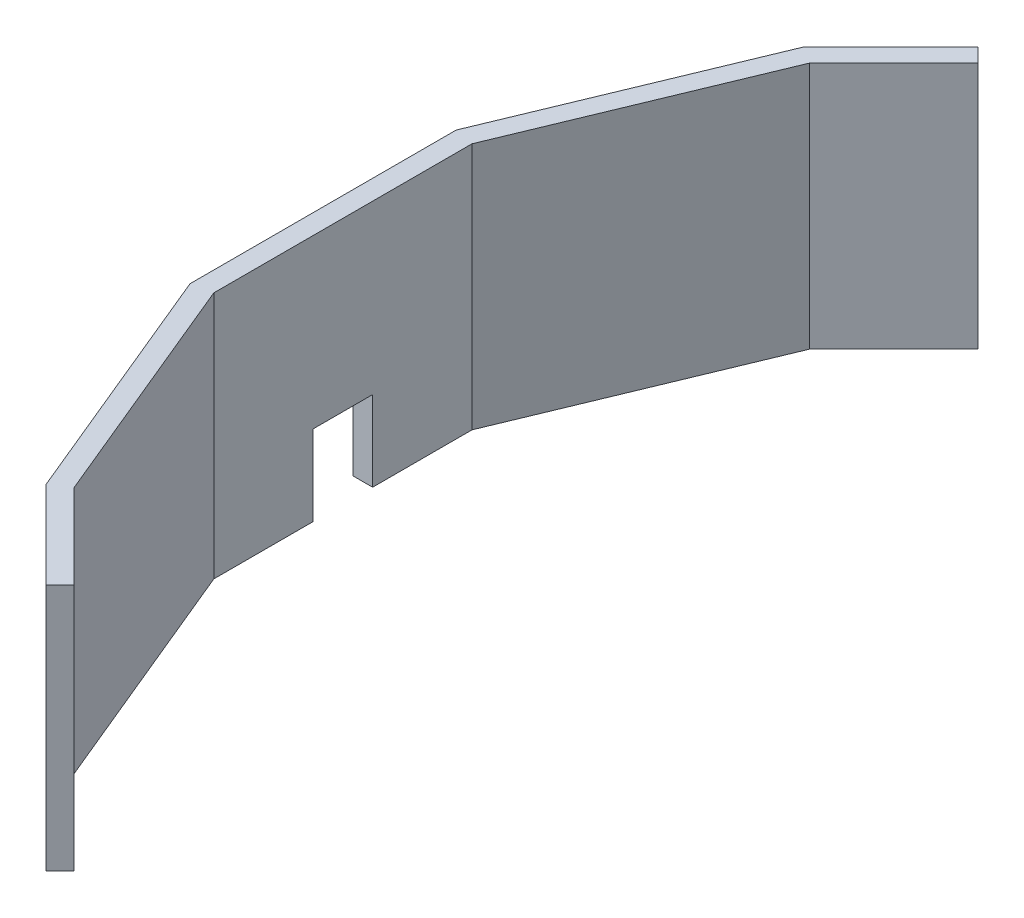
ISO-10303-21;
HEADER;
FILE_DESCRIPTION(('STEP AP214'),'2;1');
FILE_NAME('part.step','',(''),(''),'','','');
FILE_SCHEMA(('AUTOMOTIVE_DESIGN { 1 0 10303 214 1 1 1 1 }'));
ENDSEC;
DATA;
#1=APPLICATION_CONTEXT('core data for automotive mechanical design processes');
#2=APPLICATION_PROTOCOL_DEFINITION('international standard','automotive_design',2000,#1);
#3=PRODUCT_CONTEXT('',#1,'mechanical');
#4=PRODUCT('Part','Part','',(#3));
#5=PRODUCT_RELATED_PRODUCT_CATEGORY('part','',(#4));
#6=PRODUCT_DEFINITION_FORMATION('','',#4);
#7=PRODUCT_DEFINITION_CONTEXT('part definition',#1,'design');
#8=PRODUCT_DEFINITION('design','',#6,#7);
#9=PRODUCT_DEFINITION_SHAPE('','',#8);
#10=(LENGTH_UNIT() NAMED_UNIT(*) SI_UNIT(.MILLI.,.METRE.));
#11=(NAMED_UNIT(*) PLANE_ANGLE_UNIT() SI_UNIT($,.RADIAN.));
#12=(NAMED_UNIT(*) SI_UNIT($,.STERADIAN.) SOLID_ANGLE_UNIT());
#13=UNCERTAINTY_MEASURE_WITH_UNIT(LENGTH_MEASURE(1.E-05),#10,'distance_accuracy_value','');
#14=(GEOMETRIC_REPRESENTATION_CONTEXT(3) GLOBAL_UNCERTAINTY_ASSIGNED_CONTEXT((#13)) GLOBAL_UNIT_ASSIGNED_CONTEXT((#10,
#11,#12)) REPRESENTATION_CONTEXT('',''));
#15=CARTESIAN_POINT('',(0.,0.,0.));
#16=DIRECTION('',(0.,0.,1.));
#17=DIRECTION('',(1.,0.,0.));
#18=AXIS2_PLACEMENT_3D('',#15,#16,#17);
#19=CARTESIAN_POINT('',(0.,0.,0.));
#20=DIRECTION('',(0.,1.,0.));
#21=DIRECTION('',(0.,0.,1.));
#22=AXIS2_PLACEMENT_3D('',#19,#20,#21);
#23=PLANE('',#22);
#24=DIRECTION('',(0.,0.,1.));
#25=VECTOR('',#24,1.);
#26=CARTESIAN_POINT('',(-655.,0.,0.));
#27=LINE('',#26,#25);
#28=CARTESIAN_POINT('',(-655.,0.,-130.287600633676));
#29=VERTEX_POINT('',#28);
#30=CARTESIAN_POINT('',(-655.,0.,-30.));
#31=VERTEX_POINT('',#30);
#32=EDGE_CURVE('E148',#29,#31,#27,.T.);
#33=ORIENTED_EDGE('',*,*,#32,.T.);
#34=DIRECTION('',(-1.,0.,0.));
#35=VECTOR('',#34,1.);
#36=CARTESIAN_POINT('',(0.,0.,-30.));
#37=LINE('',#36,#35);
#38=CARTESIAN_POINT('',(-675.,0.,-30.));
#39=VERTEX_POINT('',#38);
#40=EDGE_CURVE('E11',#31,#39,#37,.T.);
#41=ORIENTED_EDGE('',*,*,#40,.T.);
#42=DIRECTION('',(0.,0.,1.));
#43=VECTOR('',#42,1.);
#44=CARTESIAN_POINT('',(-675.,0.,0.));
#45=LINE('',#44,#43);
#46=CARTESIAN_POINT('',(-675.,0.,-134.265847981269));
#47=VERTEX_POINT('',#46);
#48=EDGE_CURVE('E178',#47,#39,#45,.T.);
#49=ORIENTED_EDGE('',*,*,#48,.F.);
#50=DIRECTION('',(-0.38268343236509,0.,0.923879532511287));
#51=VECTOR('',#50,1.);
#52=CARTESIAN_POINT('',(-623.618684445119,0.,-258.311316846436));
#53=LINE('',#52,#51);
#54=CARTESIAN_POINT('',(-572.237368890237,0.,-382.356785711602));
#55=VERTEX_POINT('',#54);
#56=EDGE_CURVE('E175',#55,#47,#53,.T.);
#57=ORIENTED_EDGE('',*,*,#56,.F.);
#58=DIRECTION('',(0.707106781186548,0.,-0.707106781186547));
#59=VECTOR('',#58,1.);
#60=CARTESIAN_POINT('',(-477.29707730092,0.,-477.29707730092));
#61=LINE('',#60,#59);
#62=CARTESIAN_POINT('',(-484.368145112784,0.,-470.226009489055));
#63=VERTEX_POINT('',#62);
#64=EDGE_CURVE('E171',#55,#63,#61,.T.);
#65=ORIENTED_EDGE('',*,*,#64,.T.);
#66=DIRECTION('',(0.707106781186546,0.,0.707106781186549));
#67=VECTOR('',#66,1.);
#68=CARTESIAN_POINT('',(-7.07106781186569,0.,7.07106781186566));
#69=LINE('',#68,#67);
#70=CARTESIAN_POINT('',(-470.226009489053,0.,-456.083873865324));
#71=VERTEX_POINT('',#70);
#72=EDGE_CURVE('E168',#63,#71,#69,.T.);
#73=ORIENTED_EDGE('',*,*,#72,.T.);
#74=DIRECTION('',(0.707106781186549,0.,-0.707106781186547));
#75=VECTOR('',#74,1.);
#76=CARTESIAN_POINT('',(-463.154941677188,0.,-463.154941677189));
#77=LINE('',#76,#75);
#78=CARTESIAN_POINT('',(-555.282187589786,0.,-371.027695764592));
#79=VERTEX_POINT('',#78);
#80=EDGE_CURVE('E199',#79,#71,#77,.T.);
#81=ORIENTED_EDGE('',*,*,#80,.F.);
#82=DIRECTION('',(-0.38268343236509,0.,0.923879532511287));
#83=VECTOR('',#82,1.);
#84=CARTESIAN_POINT('',(-605.141093794893,0.,-250.657648199134));
#85=LINE('',#84,#83);
#86=EDGE_CURVE('E197',#79,#29,#85,.T.);
#87=ORIENTED_EDGE('',*,*,#86,.T.);
#88=EDGE_LOOP('',(#33,#41,#49,#57,#65,#73,#81,#87));
#89=FACE_BOUND('',#88,.T.);
#90=ADVANCED_FACE('F36',(#89),#23,.F.);
#91=CARTESIAN_POINT('',(-7.07106781186569,250.,7.07106781186566));
#92=DIRECTION('',(0.707106781186549,0.,-0.707106781186546));
#93=DIRECTION('',(-0.707106781186546,0.,-0.707106781186549));
#94=AXIS2_PLACEMENT_3D('',#91,#92,#93);
#95=PLANE('',#94);
#96=ORIENTED_EDGE('',*,*,#72,.F.);
#97=DIRECTION('',(0.,-1.,0.));
#98=VECTOR('',#97,1.);
#99=CARTESIAN_POINT('',(-484.368145112784,250.,-470.226009489055));
#100=LINE('',#99,#98);
#101=CARTESIAN_POINT('',(-484.368145112784,250.,-470.226009489055));
#102=VERTEX_POINT('',#101);
#103=EDGE_CURVE('E111',#102,#63,#100,.T.);
#104=ORIENTED_EDGE('',*,*,#103,.F.);
#105=DIRECTION('',(0.707106781186546,0.,0.707106781186549));
#106=VECTOR('',#105,1.);
#107=CARTESIAN_POINT('',(-7.07106781186569,250.,7.07106781186566));
#108=LINE('',#107,#106);
#109=CARTESIAN_POINT('',(-470.226009489053,250.,-456.083873865324));
#110=VERTEX_POINT('',#109);
#111=EDGE_CURVE('E201',#102,#110,#108,.T.);
#112=ORIENTED_EDGE('',*,*,#111,.T.);
#113=DIRECTION('',(0.,-1.,0.));
#114=VECTOR('',#113,1.);
#115=CARTESIAN_POINT('',(-470.226009489053,250.,-456.083873865324));
#116=LINE('',#115,#114);
#117=EDGE_CURVE('E106',#110,#71,#116,.T.);
#118=ORIENTED_EDGE('',*,*,#117,.T.);
#119=EDGE_LOOP('',(#96,#104,#112,#118));
#120=FACE_BOUND('',#119,.T.);
#121=ADVANCED_FACE('F38',(#120),#95,.T.);
#122=CARTESIAN_POINT('',(-477.29707730092,250.,-477.29707730092));
#123=DIRECTION('',(-0.707106781186547,0.,-0.707106781186548));
#124=DIRECTION('',(-0.707106781186548,0.,0.707106781186547));
#125=AXIS2_PLACEMENT_3D('',#122,#123,#124);
#126=PLANE('',#125);
#127=ORIENTED_EDGE('',*,*,#64,.F.);
#128=DIRECTION('',(0.,-1.,0.));
#129=VECTOR('',#128,1.);
#130=CARTESIAN_POINT('',(-572.237368890237,250.,-382.356785711602));
#131=LINE('',#130,#129);
#132=CARTESIAN_POINT('',(-572.237368890237,250.,-382.356785711602));
#133=VERTEX_POINT('',#132);
#134=EDGE_CURVE('E220',#133,#55,#131,.T.);
#135=ORIENTED_EDGE('',*,*,#134,.F.);
#136=DIRECTION('',(0.707106781186548,0.,-0.707106781186547));
#137=VECTOR('',#136,1.);
#138=CARTESIAN_POINT('',(-477.29707730092,250.,-477.29707730092));
#139=LINE('',#138,#137);
#140=EDGE_CURVE('E284',#133,#102,#139,.T.);
#141=ORIENTED_EDGE('',*,*,#140,.T.);
#142=ORIENTED_EDGE('',*,*,#103,.T.);
#143=EDGE_LOOP('',(#127,#135,#141,#142));
#144=FACE_BOUND('',#143,.T.);
#145=ADVANCED_FACE('F333',(#144),#126,.T.);
#146=CARTESIAN_POINT('',(-623.618684445119,250.,-258.311316846436));
#147=DIRECTION('',(0.923879532511287,0.,0.38268343236509));
#148=DIRECTION('',(0.38268343236509,0.,-0.923879532511287));
#149=AXIS2_PLACEMENT_3D('',#146,#147,#148);
#150=PLANE('',#149);
#151=ORIENTED_EDGE('',*,*,#56,.T.);
#152=DIRECTION('',(0.,-1.,0.));
#153=VECTOR('',#152,1.);
#154=CARTESIAN_POINT('',(-675.,250.,-134.265847981269));
#155=LINE('',#154,#153);
#156=CARTESIAN_POINT('',(-675.,250.,-134.265847981269));
#157=VERTEX_POINT('',#156);
#158=EDGE_CURVE('E217',#157,#47,#155,.T.);
#159=ORIENTED_EDGE('',*,*,#158,.F.);
#160=DIRECTION('',(-0.38268343236509,0.,0.923879532511287));
#161=VECTOR('',#160,1.);
#162=CARTESIAN_POINT('',(-623.618684445119,250.,-258.311316846436));
#163=LINE('',#162,#161);
#164=EDGE_CURVE('E287',#133,#157,#163,.T.);
#165=ORIENTED_EDGE('',*,*,#164,.F.);
#166=ORIENTED_EDGE('',*,*,#134,.T.);
#167=EDGE_LOOP('',(#151,#159,#165,#166));
#168=FACE_BOUND('',#167,.T.);
#169=ADVANCED_FACE('F298',(#168),#150,.F.);
#170=CARTESIAN_POINT('',(-675.,250.,0.));
#171=DIRECTION('',(1.,0.,0.));
#172=DIRECTION('',(0.,0.,-1.));
#173=AXIS2_PLACEMENT_3D('',#170,#171,#172);
#174=PLANE('',#173);
#175=ORIENTED_EDGE('',*,*,#48,.T.);
#176=DIRECTION('',(0.,1.,0.));
#177=VECTOR('',#176,1.);
#178=CARTESIAN_POINT('',(-675.,-81.,-30.));
#179=LINE('',#178,#177);
#180=CARTESIAN_POINT('',(-675.,81.,-30.));
#181=VERTEX_POINT('',#180);
#182=EDGE_CURVE('E271',#39,#181,#179,.T.);
#183=ORIENTED_EDGE('',*,*,#182,.T.);
#184=DIRECTION('',(0.,0.,1.));
#185=VECTOR('',#184,1.);
#186=CARTESIAN_POINT('',(-675.,81.,30.));
#187=LINE('',#186,#185);
#188=CARTESIAN_POINT('',(-675.,81.,30.));
#189=VERTEX_POINT('',#188);
#190=EDGE_CURVE('E265',#181,#189,#187,.T.);
#191=ORIENTED_EDGE('',*,*,#190,.T.);
#192=DIRECTION('',(0.,-1.,0.));
#193=VECTOR('',#192,1.);
#194=CARTESIAN_POINT('',(-675.,-81.,30.));
#195=LINE('',#194,#193);
#196=CARTESIAN_POINT('',(-675.,0.,30.));
#197=VERTEX_POINT('',#196);
#198=EDGE_CURVE('E261',#189,#197,#195,.T.);
#199=ORIENTED_EDGE('',*,*,#198,.T.);
#200=CARTESIAN_POINT('',(-675.,0.,134.265847981269));
#201=VERTEX_POINT('',#200);
#202=EDGE_CURVE('E177',#197,#201,#45,.T.);
#203=ORIENTED_EDGE('',*,*,#202,.T.);
#204=DIRECTION('',(0.,-1.,0.));
#205=VECTOR('',#204,1.);
#206=CARTESIAN_POINT('',(-675.,250.,134.265847981269));
#207=LINE('',#206,#205);
#208=CARTESIAN_POINT('',(-675.,250.,134.265847981269));
#209=VERTEX_POINT('',#208);
#210=EDGE_CURVE('E214',#209,#201,#207,.T.);
#211=ORIENTED_EDGE('',*,*,#210,.F.);
#212=DIRECTION('',(0.,0.,1.));
#213=VECTOR('',#212,1.);
#214=CARTESIAN_POINT('',(-675.,250.,0.));
#215=LINE('',#214,#213);
#216=EDGE_CURVE('E259',#157,#209,#215,.T.);
#217=ORIENTED_EDGE('',*,*,#216,.F.);
#218=ORIENTED_EDGE('',*,*,#158,.T.);
#219=EDGE_LOOP('',(#175,#183,#191,#199,#203,#211,#217,#218));
#220=FACE_BOUND('',#219,.T.);
#221=ADVANCED_FACE('F258',(#220),#174,.F.);
#222=CARTESIAN_POINT('',(-623.618684445118,250.,258.311316846436));
#223=DIRECTION('',(0.923879532511286,0.,-0.382683432365091));
#224=DIRECTION('',(-0.382683432365091,0.,-0.923879532511287));
#225=AXIS2_PLACEMENT_3D('',#222,#223,#224);
#226=PLANE('',#225);
#227=DIRECTION('',(0.382683432365091,0.,0.923879532511287));
#228=VECTOR('',#227,1.);
#229=CARTESIAN_POINT('',(-623.618684445118,0.,258.311316846436));
#230=LINE('',#229,#228);
#231=CARTESIAN_POINT('',(-572.237368890237,0.,382.356785711603));
#232=VERTEX_POINT('',#231);
#233=EDGE_CURVE('E181',#201,#232,#230,.T.);
#234=ORIENTED_EDGE('',*,*,#233,.T.);
#235=DIRECTION('',(0.,-1.,0.));
#236=VECTOR('',#235,1.);
#237=CARTESIAN_POINT('',(-572.237368890237,250.,382.356785711603));
#238=LINE('',#237,#236);
#239=CARTESIAN_POINT('',(-572.237368890237,250.,382.356785711603));
#240=VERTEX_POINT('',#239);
#241=EDGE_CURVE('E211',#240,#232,#238,.T.);
#242=ORIENTED_EDGE('',*,*,#241,.F.);
#243=DIRECTION('',(0.382683432365091,0.,0.923879532511287));
#244=VECTOR('',#243,1.);
#245=CARTESIAN_POINT('',(-623.618684445118,250.,258.311316846436));
#246=LINE('',#245,#244);
#247=EDGE_CURVE('E255',#209,#240,#246,.T.);
#248=ORIENTED_EDGE('',*,*,#247,.F.);
#249=ORIENTED_EDGE('',*,*,#210,.T.);
#250=EDGE_LOOP('',(#234,#242,#248,#249));
#251=FACE_BOUND('',#250,.T.);
#252=ADVANCED_FACE('F252',(#251),#226,.F.);
#253=CARTESIAN_POINT('',(-477.29707730092,250.,477.29707730092));
#254=DIRECTION('',(0.707106781186548,0.,-0.707106781186547));
#255=DIRECTION('',(-0.707106781186547,0.,-0.707106781186548));
#256=AXIS2_PLACEMENT_3D('',#253,#254,#255);
#257=PLANE('',#256);
#258=DIRECTION('',(0.707106781186547,0.,0.707106781186548));
#259=VECTOR('',#258,1.);
#260=CARTESIAN_POINT('',(-477.29707730092,0.,477.29707730092));
#261=LINE('',#260,#259);
#262=CARTESIAN_POINT('',(-484.368145112784,0.,470.226009489055));
#263=VERTEX_POINT('',#262);
#264=EDGE_CURVE('E183',#232,#263,#261,.T.);
#265=ORIENTED_EDGE('',*,*,#264,.T.);
#266=DIRECTION('',(0.,-1.,0.));
#267=VECTOR('',#266,1.);
#268=CARTESIAN_POINT('',(-484.368145112784,250.,470.226009489055));
#269=LINE('',#268,#267);
#270=CARTESIAN_POINT('',(-484.368145112784,250.,470.226009489055));
#271=VERTEX_POINT('',#270);
#272=EDGE_CURVE('E209',#271,#263,#269,.T.);
#273=ORIENTED_EDGE('',*,*,#272,.F.);
#274=DIRECTION('',(0.707106781186547,0.,0.707106781186548));
#275=VECTOR('',#274,1.);
#276=CARTESIAN_POINT('',(-477.29707730092,250.,477.29707730092));
#277=LINE('',#276,#275);
#278=EDGE_CURVE('E291',#240,#271,#277,.T.);
#279=ORIENTED_EDGE('',*,*,#278,.F.);
#280=ORIENTED_EDGE('',*,*,#241,.T.);
#281=EDGE_LOOP('',(#265,#273,#279,#280));
#282=FACE_BOUND('',#281,.T.);
#283=ADVANCED_FACE('F249',(#282),#257,.F.);
#284=CARTESIAN_POINT('',(-7.07106781186569,250.,-7.07106781186566));
#285=DIRECTION('',(0.707106781186549,0.,0.707106781186546));
#286=DIRECTION('',(0.707106781186546,0.,-0.707106781186549));
#287=AXIS2_PLACEMENT_3D('',#284,#285,#286);
#288=PLANE('',#287);
#289=DIRECTION('',(-0.707106781186546,0.,0.707106781186549));
#290=VECTOR('',#289,1.);
#291=CARTESIAN_POINT('',(-7.07106781186569,0.,-7.07106781186566));
#292=LINE('',#291,#290);
#293=CARTESIAN_POINT('',(-470.226009489053,0.,456.083873865324));
#294=VERTEX_POINT('',#293);
#295=EDGE_CURVE('E186',#294,#263,#292,.T.);
#296=ORIENTED_EDGE('',*,*,#295,.F.);
#297=DIRECTION('',(0.,-1.,0.));
#298=VECTOR('',#297,1.);
#299=CARTESIAN_POINT('',(-470.226009489053,250.,456.083873865324));
#300=LINE('',#299,#298);
#301=CARTESIAN_POINT('',(-470.226009489053,250.,456.083873865324));
#302=VERTEX_POINT('',#301);
#303=EDGE_CURVE('E207',#302,#294,#300,.T.);
#304=ORIENTED_EDGE('',*,*,#303,.F.);
#305=DIRECTION('',(-0.707106781186546,0.,0.707106781186549));
#306=VECTOR('',#305,1.);
#307=CARTESIAN_POINT('',(-7.07106781186569,250.,-7.07106781186566));
#308=LINE('',#307,#306);
#309=EDGE_CURVE('E246',#302,#271,#308,.T.);
#310=ORIENTED_EDGE('',*,*,#309,.T.);
#311=ORIENTED_EDGE('',*,*,#272,.T.);
#312=EDGE_LOOP('',(#296,#304,#310,#311));
#313=FACE_BOUND('',#312,.T.);
#314=ADVANCED_FACE('F244',(#313),#288,.T.);
#315=CARTESIAN_POINT('',(-463.154941677188,250.,463.154941677189));
#316=DIRECTION('',(0.707106781186546,0.,-0.707106781186549));
#317=DIRECTION('',(-0.707106781186549,0.,-0.707106781186546));
#318=AXIS2_PLACEMENT_3D('',#315,#316,#317);
#319=PLANE('',#318);
#320=DIRECTION('',(0.707106781186549,0.,0.707106781186546));
#321=VECTOR('',#320,1.);
#322=CARTESIAN_POINT('',(-463.154941677188,0.,463.154941677189));
#323=LINE('',#322,#321);
#324=CARTESIAN_POINT('',(-555.282187589785,0.,371.027695764592));
#325=VERTEX_POINT('',#324);
#326=EDGE_CURVE('E189',#325,#294,#323,.T.);
#327=ORIENTED_EDGE('',*,*,#326,.F.);
#328=DIRECTION('',(0.,-1.,0.));
#329=VECTOR('',#328,1.);
#330=CARTESIAN_POINT('',(-555.282187589785,250.,371.027695764592));
#331=LINE('',#330,#329);
#332=CARTESIAN_POINT('',(-555.282187589785,250.,371.027695764592));
#333=VERTEX_POINT('',#332);
#334=EDGE_CURVE('E205',#333,#325,#331,.T.);
#335=ORIENTED_EDGE('',*,*,#334,.F.);
#336=DIRECTION('',(0.707106781186549,0.,0.707106781186546));
#337=VECTOR('',#336,1.);
#338=CARTESIAN_POINT('',(-463.154941677188,250.,463.154941677189));
#339=LINE('',#338,#337);
#340=EDGE_CURVE('E240',#333,#302,#339,.T.);
#341=ORIENTED_EDGE('',*,*,#340,.T.);
#342=ORIENTED_EDGE('',*,*,#303,.T.);
#343=EDGE_LOOP('',(#327,#335,#341,#342));
#344=FACE_BOUND('',#343,.T.);
#345=ADVANCED_FACE('F238',(#344),#319,.T.);
#346=CARTESIAN_POINT('',(-605.141093794893,250.,250.657648199134));
#347=DIRECTION('',(0.923879532511286,0.,-0.382683432365091));
#348=DIRECTION('',(-0.382683432365091,0.,-0.923879532511286));
#349=AXIS2_PLACEMENT_3D('',#346,#347,#348);
#350=PLANE('',#349);
#351=DIRECTION('',(0.382683432365091,0.,0.923879532511286));
#352=VECTOR('',#351,1.);
#353=CARTESIAN_POINT('',(-605.141093794893,0.,250.657648199134));
#354=LINE('',#353,#352);
#355=CARTESIAN_POINT('',(-655.,0.,130.287600633676));
#356=VERTEX_POINT('',#355);
#357=EDGE_CURVE('E192',#356,#325,#354,.T.);
#358=ORIENTED_EDGE('',*,*,#357,.F.);
#359=DIRECTION('',(0.,-1.,0.));
#360=VECTOR('',#359,1.);
#361=CARTESIAN_POINT('',(-655.,250.,130.287600633676));
#362=LINE('',#361,#360);
#363=CARTESIAN_POINT('',(-655.,250.,130.287600633676));
#364=VERTEX_POINT('',#363);
#365=EDGE_CURVE('E153',#364,#356,#362,.T.);
#366=ORIENTED_EDGE('',*,*,#365,.F.);
#367=DIRECTION('',(0.382683432365091,0.,0.923879532511286));
#368=VECTOR('',#367,1.);
#369=CARTESIAN_POINT('',(-605.141093794893,250.,250.657648199134));
#370=LINE('',#369,#368);
#371=EDGE_CURVE('E161',#364,#333,#370,.T.);
#372=ORIENTED_EDGE('',*,*,#371,.T.);
#373=ORIENTED_EDGE('',*,*,#334,.T.);
#374=EDGE_LOOP('',(#358,#366,#372,#373));
#375=FACE_BOUND('',#374,.T.);
#376=ADVANCED_FACE('F233',(#375),#350,.T.);
#377=CARTESIAN_POINT('',(-655.,250.,0.));
#378=DIRECTION('',(1.,0.,0.));
#379=DIRECTION('',(0.,0.,-1.));
#380=AXIS2_PLACEMENT_3D('',#377,#378,#379);
#381=PLANE('',#380);
#382=DIRECTION('',(0.,1.,0.));
#383=VECTOR('',#382,1.);
#384=CARTESIAN_POINT('',(-655.,-81.,-30.));
#385=LINE('',#384,#383);
#386=CARTESIAN_POINT('',(-655.,81.,-30.));
#387=VERTEX_POINT('',#386);
#388=EDGE_CURVE('E275',#31,#387,#385,.T.);
#389=ORIENTED_EDGE('',*,*,#388,.F.);
#390=ORIENTED_EDGE('',*,*,#32,.F.);
#391=DIRECTION('',(0.,-1.,0.));
#392=VECTOR('',#391,1.);
#393=CARTESIAN_POINT('',(-655.,250.,-130.287600633676));
#394=LINE('',#393,#392);
#395=CARTESIAN_POINT('',(-655.,250.,-130.287600633676));
#396=VERTEX_POINT('',#395);
#397=EDGE_CURVE('E141',#396,#29,#394,.T.);
#398=ORIENTED_EDGE('',*,*,#397,.F.);
#399=DIRECTION('',(0.,0.,1.));
#400=VECTOR('',#399,1.);
#401=CARTESIAN_POINT('',(-655.,250.,0.));
#402=LINE('',#401,#400);
#403=EDGE_CURVE('E146',#396,#364,#402,.T.);
#404=ORIENTED_EDGE('',*,*,#403,.T.);
#405=ORIENTED_EDGE('',*,*,#365,.T.);
#406=CARTESIAN_POINT('',(-655.,0.,30.));
#407=VERTEX_POINT('',#406);
#408=EDGE_CURVE('E195',#407,#356,#27,.T.);
#409=ORIENTED_EDGE('',*,*,#408,.F.);
#410=DIRECTION('',(0.,-1.,0.));
#411=VECTOR('',#410,1.);
#412=CARTESIAN_POINT('',(-655.,-81.,30.));
#413=LINE('',#412,#411);
#414=CARTESIAN_POINT('',(-655.,81.,30.));
#415=VERTEX_POINT('',#414);
#416=EDGE_CURVE('E51',#415,#407,#413,.T.);
#417=ORIENTED_EDGE('',*,*,#416,.F.);
#418=DIRECTION('',(0.,0.,1.));
#419=VECTOR('',#418,1.);
#420=CARTESIAN_POINT('',(-655.,81.,30.));
#421=LINE('',#420,#419);
#422=EDGE_CURVE('E278',#387,#415,#421,.T.);
#423=ORIENTED_EDGE('',*,*,#422,.F.);
#424=EDGE_LOOP('',(#389,#390,#398,#404,#405,#409,#417,#423));
#425=FACE_BOUND('',#424,.T.);
#426=ADVANCED_FACE('F144',(#425),#381,.T.);
#427=CARTESIAN_POINT('',(-605.141093794893,250.,-250.657648199134));
#428=DIRECTION('',(0.923879532511287,0.,0.38268343236509));
#429=DIRECTION('',(0.38268343236509,0.,-0.923879532511287));
#430=AXIS2_PLACEMENT_3D('',#427,#428,#429);
#431=PLANE('',#430);
#432=ORIENTED_EDGE('',*,*,#86,.F.);
#433=DIRECTION('',(0.,-1.,0.));
#434=VECTOR('',#433,1.);
#435=CARTESIAN_POINT('',(-555.282187589786,250.,-371.027695764592));
#436=LINE('',#435,#434);
#437=CARTESIAN_POINT('',(-555.282187589786,250.,-371.027695764592));
#438=VERTEX_POINT('',#437);
#439=EDGE_CURVE('E154',#438,#79,#436,.T.);
#440=ORIENTED_EDGE('',*,*,#439,.F.);
#441=DIRECTION('',(-0.38268343236509,0.,0.923879532511287));
#442=VECTOR('',#441,1.);
#443=CARTESIAN_POINT('',(-605.141093794893,250.,-250.657648199134));
#444=LINE('',#443,#442);
#445=EDGE_CURVE('E158',#438,#396,#444,.T.);
#446=ORIENTED_EDGE('',*,*,#445,.T.);
#447=ORIENTED_EDGE('',*,*,#397,.T.);
#448=EDGE_LOOP('',(#432,#440,#446,#447));
#449=FACE_BOUND('',#448,.T.);
#450=ADVANCED_FACE('F163',(#449),#431,.T.);
#451=CARTESIAN_POINT('',(-463.154941677188,250.,-463.154941677189));
#452=DIRECTION('',(-0.707106781186547,0.,-0.707106781186549));
#453=DIRECTION('',(-0.707106781186549,0.,0.707106781186547));
#454=AXIS2_PLACEMENT_3D('',#451,#452,#453);
#455=PLANE('',#454);
#456=ORIENTED_EDGE('',*,*,#80,.T.);
#457=ORIENTED_EDGE('',*,*,#117,.F.);
#458=DIRECTION('',(0.707106781186549,0.,-0.707106781186547));
#459=VECTOR('',#458,1.);
#460=CARTESIAN_POINT('',(-463.154941677188,250.,-463.154941677189));
#461=LINE('',#460,#459);
#462=EDGE_CURVE('E60',#438,#110,#461,.T.);
#463=ORIENTED_EDGE('',*,*,#462,.F.);
#464=ORIENTED_EDGE('',*,*,#439,.T.);
#465=EDGE_LOOP('',(#456,#457,#463,#464));
#466=FACE_BOUND('',#465,.T.);
#467=ADVANCED_FACE('F340',(#466),#455,.F.);
#468=CARTESIAN_POINT('',(0.,250.,0.));
#469=DIRECTION('',(0.,1.,0.));
#470=DIRECTION('',(0.,0.,1.));
#471=AXIS2_PLACEMENT_3D('',#468,#469,#470);
#472=PLANE('',#471);
#473=ORIENTED_EDGE('',*,*,#111,.F.);
#474=ORIENTED_EDGE('',*,*,#140,.F.);
#475=ORIENTED_EDGE('',*,*,#164,.T.);
#476=ORIENTED_EDGE('',*,*,#216,.T.);
#477=ORIENTED_EDGE('',*,*,#247,.T.);
#478=ORIENTED_EDGE('',*,*,#278,.T.);
#479=ORIENTED_EDGE('',*,*,#309,.F.);
#480=ORIENTED_EDGE('',*,*,#340,.F.);
#481=ORIENTED_EDGE('',*,*,#371,.F.);
#482=ORIENTED_EDGE('',*,*,#403,.F.);
#483=ORIENTED_EDGE('',*,*,#445,.F.);
#484=ORIENTED_EDGE('',*,*,#462,.T.);
#485=EDGE_LOOP('',(#473,#474,#475,#476,#477,#478,#479,#480,#481,#482,#483,#484));
#486=FACE_BOUND('',#485,.T.);
#487=ADVANCED_FACE('F157',(#486),#472,.T.);
#488=ORIENTED_EDGE('',*,*,#202,.F.);
#489=DIRECTION('',(1.,0.,0.));
#490=VECTOR('',#489,1.);
#491=CARTESIAN_POINT('',(0.,0.,30.));
#492=LINE('',#491,#490);
#493=EDGE_CURVE('E44',#197,#407,#492,.T.);
#494=ORIENTED_EDGE('',*,*,#493,.T.);
#495=ORIENTED_EDGE('',*,*,#408,.T.);
#496=ORIENTED_EDGE('',*,*,#357,.T.);
#497=ORIENTED_EDGE('',*,*,#326,.T.);
#498=ORIENTED_EDGE('',*,*,#295,.T.);
#499=ORIENTED_EDGE('',*,*,#264,.F.);
#500=ORIENTED_EDGE('',*,*,#233,.F.);
#501=EDGE_LOOP('',(#488,#494,#495,#496,#497,#498,#499,#500));
#502=FACE_BOUND('',#501,.T.);
#503=ADVANCED_FACE('F225',(#502),#23,.F.);
#504=CARTESIAN_POINT('',(-675.,-81.,-30.));
#505=DIRECTION('',(0.,0.,-1.));
#506=DIRECTION('',(-1.,0.,0.));
#507=AXIS2_PLACEMENT_3D('',#504,#505,#506);
#508=PLANE('',#507);
#509=ORIENTED_EDGE('',*,*,#388,.T.);
#510=DIRECTION('',(1.,0.,0.));
#511=VECTOR('',#510,1.);
#512=CARTESIAN_POINT('',(-675.,81.,-30.));
#513=LINE('',#512,#511);
#514=EDGE_CURVE('E267',#181,#387,#513,.T.);
#515=ORIENTED_EDGE('',*,*,#514,.F.);
#516=ORIENTED_EDGE('',*,*,#182,.F.);
#517=ORIENTED_EDGE('',*,*,#40,.F.);
#518=EDGE_LOOP('',(#509,#515,#516,#517));
#519=FACE_BOUND('',#518,.T.);
#520=ADVANCED_FACE('F307',(#519),#508,.F.);
#521=CARTESIAN_POINT('',(-675.,-81.,30.));
#522=DIRECTION('',(0.,0.,1.));
#523=DIRECTION('',(1.,0.,0.));
#524=AXIS2_PLACEMENT_3D('',#521,#522,#523);
#525=PLANE('',#524);
#526=ORIENTED_EDGE('',*,*,#198,.F.);
#527=DIRECTION('',(1.,0.,0.));
#528=VECTOR('',#527,1.);
#529=CARTESIAN_POINT('',(-675.,81.,30.));
#530=LINE('',#529,#528);
#531=EDGE_CURVE('E172',#189,#415,#530,.T.);
#532=ORIENTED_EDGE('',*,*,#531,.T.);
#533=ORIENTED_EDGE('',*,*,#416,.T.);
#534=ORIENTED_EDGE('',*,*,#493,.F.);
#535=EDGE_LOOP('',(#526,#532,#533,#534));
#536=FACE_BOUND('',#535,.T.);
#537=ADVANCED_FACE('F319',(#536),#525,.F.);
#538=CARTESIAN_POINT('',(-675.,81.,30.));
#539=DIRECTION('',(0.,1.,0.));
#540=DIRECTION('',(0.,0.,1.));
#541=AXIS2_PLACEMENT_3D('',#538,#539,#540);
#542=PLANE('',#541);
#543=ORIENTED_EDGE('',*,*,#422,.T.);
#544=ORIENTED_EDGE('',*,*,#531,.F.);
#545=ORIENTED_EDGE('',*,*,#190,.F.);
#546=ORIENTED_EDGE('',*,*,#514,.T.);
#547=EDGE_LOOP('',(#543,#544,#545,#546));
#548=FACE_BOUND('',#547,.T.);
#549=ADVANCED_FACE('F314',(#548),#542,.F.);
#550=CLOSED_SHELL('',(#90,#121,#145,#169,#221,#252,#283,#314,#345,#376,#426,#450,#467,#487,#503,
#520,#537,#549));
#551=MANIFOLD_SOLID_BREP('B2',#550);
#552=ADVANCED_BREP_SHAPE_REPRESENTATION('',(#18,#551),#14);
#553=SHAPE_DEFINITION_REPRESENTATION(#9,#552);
ENDSEC;
END-ISO-10303-21;
